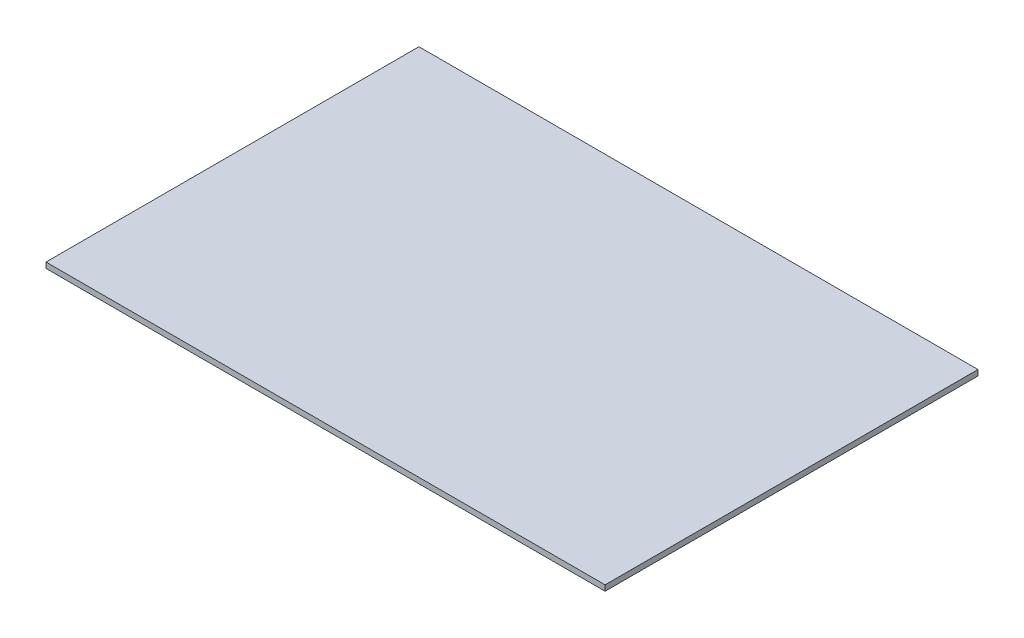
ISO-10303-21;
HEADER;
FILE_DESCRIPTION(('STEP AP214'),'2;1');
FILE_NAME('part.step','',(''),(''),'','','');
FILE_SCHEMA(('AUTOMOTIVE_DESIGN { 1 0 10303 214 1 1 1 1 }'));
ENDSEC;
DATA;
#1=APPLICATION_CONTEXT('core data for automotive mechanical design processes');
#2=APPLICATION_PROTOCOL_DEFINITION('international standard','automotive_design',2000,#1);
#3=PRODUCT_CONTEXT('',#1,'mechanical');
#4=PRODUCT('Part','Part','',(#3));
#5=PRODUCT_RELATED_PRODUCT_CATEGORY('part','',(#4));
#6=PRODUCT_DEFINITION_FORMATION('','',#4);
#7=PRODUCT_DEFINITION_CONTEXT('part definition',#1,'design');
#8=PRODUCT_DEFINITION('design','',#6,#7);
#9=PRODUCT_DEFINITION_SHAPE('','',#8);
#10=(LENGTH_UNIT() NAMED_UNIT(*) SI_UNIT(.MILLI.,.METRE.));
#11=(NAMED_UNIT(*) PLANE_ANGLE_UNIT() SI_UNIT($,.RADIAN.));
#12=(NAMED_UNIT(*) SI_UNIT($,.STERADIAN.) SOLID_ANGLE_UNIT());
#13=UNCERTAINTY_MEASURE_WITH_UNIT(LENGTH_MEASURE(1.E-05),#10,'distance_accuracy_value','');
#14=(GEOMETRIC_REPRESENTATION_CONTEXT(3) GLOBAL_UNCERTAINTY_ASSIGNED_CONTEXT((#13)) GLOBAL_UNIT_ASSIGNED_CONTEXT((#10,
#11,#12)) REPRESENTATION_CONTEXT('',''));
#15=CARTESIAN_POINT('',(0.,0.,0.));
#16=DIRECTION('',(0.,0.,1.));
#17=DIRECTION('',(1.,0.,0.));
#18=AXIS2_PLACEMENT_3D('',#15,#16,#17);
#19=CARTESIAN_POINT('',(0.,10.,0.));
#20=DIRECTION('',(1.,0.,0.));
#21=DIRECTION('',(0.,0.,-1.));
#22=AXIS2_PLACEMENT_3D('',#19,#20,#21);
#23=PLANE('',#22);
#24=DIRECTION('',(0.,0.,1.));
#25=VECTOR('',#24,1.);
#26=CARTESIAN_POINT('',(0.,0.,0.));
#27=LINE('',#26,#25);
#28=CARTESIAN_POINT('',(0.,0.,-667.));
#29=VERTEX_POINT('',#28);
#30=CARTESIAN_POINT('',(0.,0.,0.));
#31=VERTEX_POINT('',#30);
#32=EDGE_CURVE('E94',#29,#31,#27,.T.);
#33=ORIENTED_EDGE('',*,*,#32,.T.);
#34=DIRECTION('',(0.,-1.,0.));
#35=VECTOR('',#34,1.);
#36=CARTESIAN_POINT('',(0.,10.,0.));
#37=LINE('',#36,#35);
#38=CARTESIAN_POINT('',(0.,10.,0.));
#39=VERTEX_POINT('',#38);
#40=EDGE_CURVE('E11',#39,#31,#37,.T.);
#41=ORIENTED_EDGE('',*,*,#40,.F.);
#42=DIRECTION('',(0.,0.,1.));
#43=VECTOR('',#42,1.);
#44=CARTESIAN_POINT('',(0.,10.,0.));
#45=LINE('',#44,#43);
#46=CARTESIAN_POINT('',(0.,10.,-667.));
#47=VERTEX_POINT('',#46);
#48=EDGE_CURVE('E82',#47,#39,#45,.T.);
#49=ORIENTED_EDGE('',*,*,#48,.F.);
#50=DIRECTION('',(0.,-1.,0.));
#51=VECTOR('',#50,1.);
#52=CARTESIAN_POINT('',(0.,10.,-667.));
#53=LINE('',#52,#51);
#54=EDGE_CURVE('E90',#47,#29,#53,.T.);
#55=ORIENTED_EDGE('',*,*,#54,.T.);
#56=EDGE_LOOP('',(#33,#41,#49,#55));
#57=FACE_BOUND('',#56,.T.);
#58=ADVANCED_FACE('F31',(#57),#23,.F.);
#59=CARTESIAN_POINT('',(0.,10.,0.));
#60=DIRECTION('',(0.,0.,-1.));
#61=DIRECTION('',(-1.,0.,0.));
#62=AXIS2_PLACEMENT_3D('',#59,#60,#61);
#63=PLANE('',#62);
#64=DIRECTION('',(1.,0.,0.));
#65=VECTOR('',#64,1.);
#66=CARTESIAN_POINT('',(0.,0.,0.));
#67=LINE('',#66,#65);
#68=CARTESIAN_POINT('',(1000.,0.,0.));
#69=VERTEX_POINT('',#68);
#70=EDGE_CURVE('E86',#31,#69,#67,.T.);
#71=ORIENTED_EDGE('',*,*,#70,.T.);
#72=DIRECTION('',(0.,-1.,0.));
#73=VECTOR('',#72,1.);
#74=CARTESIAN_POINT('',(1000.,10.,0.));
#75=LINE('',#74,#73);
#76=CARTESIAN_POINT('',(1000.,10.,0.));
#77=VERTEX_POINT('',#76);
#78=EDGE_CURVE('E39',#77,#69,#75,.T.);
#79=ORIENTED_EDGE('',*,*,#78,.F.);
#80=DIRECTION('',(1.,0.,0.));
#81=VECTOR('',#80,1.);
#82=CARTESIAN_POINT('',(0.,10.,0.));
#83=LINE('',#82,#81);
#84=EDGE_CURVE('E77',#39,#77,#83,.T.);
#85=ORIENTED_EDGE('',*,*,#84,.F.);
#86=ORIENTED_EDGE('',*,*,#40,.T.);
#87=EDGE_LOOP('',(#71,#79,#85,#86));
#88=FACE_BOUND('',#87,.T.);
#89=ADVANCED_FACE('F85',(#88),#63,.F.);
#90=CARTESIAN_POINT('',(1000.,10.,0.));
#91=DIRECTION('',(-1.,0.,0.));
#92=DIRECTION('',(0.,0.,1.));
#93=AXIS2_PLACEMENT_3D('',#90,#91,#92);
#94=PLANE('',#93);
#95=DIRECTION('',(0.,0.,-1.));
#96=VECTOR('',#95,1.);
#97=CARTESIAN_POINT('',(1000.,0.,0.));
#98=LINE('',#97,#96);
#99=CARTESIAN_POINT('',(1000.,0.,-667.));
#100=VERTEX_POINT('',#99);
#101=EDGE_CURVE('E64',#69,#100,#98,.T.);
#102=ORIENTED_EDGE('',*,*,#101,.T.);
#103=DIRECTION('',(0.,-1.,0.));
#104=VECTOR('',#103,1.);
#105=CARTESIAN_POINT('',(1000.,10.,-667.));
#106=LINE('',#105,#104);
#107=CARTESIAN_POINT('',(1000.,10.,-667.));
#108=VERTEX_POINT('',#107);
#109=EDGE_CURVE('E87',#108,#100,#106,.T.);
#110=ORIENTED_EDGE('',*,*,#109,.F.);
#111=DIRECTION('',(0.,0.,-1.));
#112=VECTOR('',#111,1.);
#113=CARTESIAN_POINT('',(1000.,10.,0.));
#114=LINE('',#113,#112);
#115=EDGE_CURVE('E80',#77,#108,#114,.T.);
#116=ORIENTED_EDGE('',*,*,#115,.F.);
#117=ORIENTED_EDGE('',*,*,#78,.T.);
#118=EDGE_LOOP('',(#102,#110,#116,#117));
#119=FACE_BOUND('',#118,.T.);
#120=ADVANCED_FACE('F88',(#119),#94,.F.);
#121=CARTESIAN_POINT('',(0.,10.,-667.));
#122=DIRECTION('',(0.,0.,1.));
#123=DIRECTION('',(1.,0.,0.));
#124=AXIS2_PLACEMENT_3D('',#121,#122,#123);
#125=PLANE('',#124);
#126=DIRECTION('',(-1.,0.,0.));
#127=VECTOR('',#126,1.);
#128=CARTESIAN_POINT('',(0.,0.,-667.));
#129=LINE('',#128,#127);
#130=EDGE_CURVE('E70',#100,#29,#129,.T.);
#131=ORIENTED_EDGE('',*,*,#130,.T.);
#132=ORIENTED_EDGE('',*,*,#54,.F.);
#133=DIRECTION('',(-1.,0.,0.));
#134=VECTOR('',#133,1.);
#135=CARTESIAN_POINT('',(0.,10.,-667.));
#136=LINE('',#135,#134);
#137=EDGE_CURVE('E47',#108,#47,#136,.T.);
#138=ORIENTED_EDGE('',*,*,#137,.F.);
#139=ORIENTED_EDGE('',*,*,#109,.T.);
#140=EDGE_LOOP('',(#131,#132,#138,#139));
#141=FACE_BOUND('',#140,.T.);
#142=ADVANCED_FACE('F101',(#141),#125,.F.);
#143=CARTESIAN_POINT('',(0.,10.,-667.));
#144=DIRECTION('',(0.,-1.,0.));
#145=DIRECTION('',(0.,0.,-1.));
#146=AXIS2_PLACEMENT_3D('',#143,#144,#145);
#147=PLANE('',#146);
#148=ORIENTED_EDGE('',*,*,#48,.T.);
#149=ORIENTED_EDGE('',*,*,#84,.T.);
#150=ORIENTED_EDGE('',*,*,#115,.T.);
#151=ORIENTED_EDGE('',*,*,#137,.T.);
#152=EDGE_LOOP('',(#148,#149,#150,#151));
#153=FACE_BOUND('',#152,.T.);
#154=ADVANCED_FACE('F78',(#153),#147,.F.);
#155=CARTESIAN_POINT('',(0.,0.,-667.));
#156=DIRECTION('',(0.,-1.,0.));
#157=DIRECTION('',(0.,0.,-1.));
#158=AXIS2_PLACEMENT_3D('',#155,#156,#157);
#159=PLANE('',#158);
#160=ORIENTED_EDGE('',*,*,#32,.F.);
#161=ORIENTED_EDGE('',*,*,#130,.F.);
#162=ORIENTED_EDGE('',*,*,#101,.F.);
#163=ORIENTED_EDGE('',*,*,#70,.F.);
#164=EDGE_LOOP('',(#160,#161,#162,#163));
#165=FACE_BOUND('',#164,.T.);
#166=ADVANCED_FACE('F104',(#165),#159,.T.);
#167=CLOSED_SHELL('',(#58,#89,#120,#142,#154,#166));
#168=MANIFOLD_SOLID_BREP('B2',#167);
#169=ADVANCED_BREP_SHAPE_REPRESENTATION('',(#18,#168),#14);
#170=SHAPE_DEFINITION_REPRESENTATION(#9,#169);
ENDSEC;
END-ISO-10303-21;
